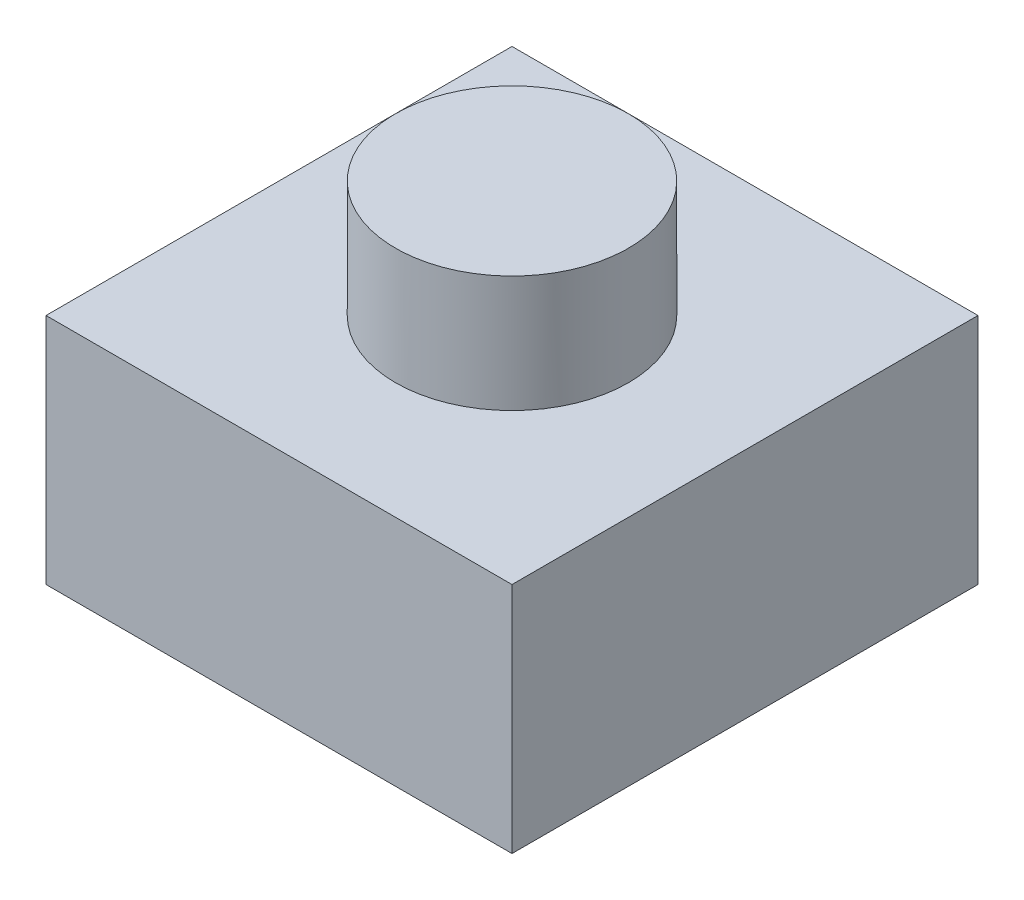
ISO-10303-21;
HEADER;
FILE_DESCRIPTION(('STEP AP214'),'2;1');
FILE_NAME('part.step','',(''),(''),'','','');
FILE_SCHEMA(('AUTOMOTIVE_DESIGN { 1 0 10303 214 1 1 1 1 }'));
ENDSEC;
DATA;
#1=APPLICATION_CONTEXT('core data for automotive mechanical design processes');
#2=APPLICATION_PROTOCOL_DEFINITION('international standard','automotive_design',2000,#1);
#3=PRODUCT_CONTEXT('',#1,'mechanical');
#4=PRODUCT('Part','Part','',(#3));
#5=PRODUCT_RELATED_PRODUCT_CATEGORY('part','',(#4));
#6=PRODUCT_DEFINITION_FORMATION('','',#4);
#7=PRODUCT_DEFINITION_CONTEXT('part definition',#1,'design');
#8=PRODUCT_DEFINITION('design','',#6,#7);
#9=PRODUCT_DEFINITION_SHAPE('','',#8);
#10=(LENGTH_UNIT() NAMED_UNIT(*) SI_UNIT(.MILLI.,.METRE.));
#11=(NAMED_UNIT(*) PLANE_ANGLE_UNIT() SI_UNIT($,.RADIAN.));
#12=(NAMED_UNIT(*) SI_UNIT($,.STERADIAN.) SOLID_ANGLE_UNIT());
#13=UNCERTAINTY_MEASURE_WITH_UNIT(LENGTH_MEASURE(1.E-05),#10,'distance_accuracy_value','');
#14=(GEOMETRIC_REPRESENTATION_CONTEXT(3) GLOBAL_UNCERTAINTY_ASSIGNED_CONTEXT((#13)) GLOBAL_UNIT_ASSIGNED_CONTEXT((#10,
#11,#12)) REPRESENTATION_CONTEXT('',''));
#15=CARTESIAN_POINT('',(0.,0.,0.));
#16=DIRECTION('',(0.,0.,1.));
#17=DIRECTION('',(1.,0.,0.));
#18=AXIS2_PLACEMENT_3D('',#15,#16,#17);
#19=CARTESIAN_POINT('',(0.,40.,0.));
#20=DIRECTION('',(0.,-1.,0.));
#21=DIRECTION('',(0.,0.,-1.));
#22=AXIS2_PLACEMENT_3D('',#19,#20,#21);
#23=PLANE('',#22);
#24=DIRECTION('',(0.,0.,1.));
#25=VECTOR('',#24,1.);
#26=CARTESIAN_POINT('',(0.,40.,0.));
#27=LINE('',#26,#25);
#28=CARTESIAN_POINT('',(0.,40.,-80.));
#29=VERTEX_POINT('',#28);
#30=CARTESIAN_POINT('',(0.,40.,0.));
#31=VERTEX_POINT('',#30);
#32=EDGE_CURVE('E98',#29,#31,#27,.T.);
#33=ORIENTED_EDGE('',*,*,#32,.T.);
#34=DIRECTION('',(1.,0.,0.));
#35=VECTOR('',#34,1.);
#36=CARTESIAN_POINT('',(0.,40.,0.));
#37=LINE('',#36,#35);
#38=CARTESIAN_POINT('',(80.,40.,0.));
#39=VERTEX_POINT('',#38);
#40=EDGE_CURVE('E93',#31,#39,#37,.T.);
#41=ORIENTED_EDGE('',*,*,#40,.T.);
#42=DIRECTION('',(0.,0.,-1.));
#43=VECTOR('',#42,1.);
#44=CARTESIAN_POINT('',(80.,40.,0.));
#45=LINE('',#44,#43);
#46=CARTESIAN_POINT('',(80.,40.,-80.));
#47=VERTEX_POINT('',#46);
#48=EDGE_CURVE('E96',#39,#47,#45,.T.);
#49=ORIENTED_EDGE('',*,*,#48,.T.);
#50=DIRECTION('',(-1.,0.,0.));
#51=VECTOR('',#50,1.);
#52=CARTESIAN_POINT('',(0.,40.,-80.));
#53=LINE('',#52,#51);
#54=EDGE_CURVE('E63',#47,#29,#53,.T.);
#55=ORIENTED_EDGE('',*,*,#54,.T.);
#56=EDGE_LOOP('',(#33,#41,#49,#55));
#57=FACE_BOUND('',#56,.T.);
#58=CARTESIAN_POINT('',(40.,40.,-40.));
#59=DIRECTION('',(0.,1.,0.));
#60=DIRECTION('',(0.,0.,1.));
#61=AXIS2_PLACEMENT_3D('',#58,#59,#60);
#62=CIRCLE('',#61,20.);
#63=CARTESIAN_POINT('',(40.,40.,-20.));
#64=VERTEX_POINT('',#63);
#65=EDGE_CURVE('E118',#64,#64,#62,.T.);
#66=ORIENTED_EDGE('',*,*,#65,.F.);
#67=EDGE_LOOP('',(#66));
#68=FACE_BOUND('',#67,.T.);
#69=ADVANCED_FACE('F45',(#57,#68),#23,.F.);
#70=CARTESIAN_POINT('',(0.,0.,0.));
#71=DIRECTION('',(0.,-1.,0.));
#72=DIRECTION('',(0.,0.,-1.));
#73=AXIS2_PLACEMENT_3D('',#70,#71,#72);
#74=PLANE('',#73);
#75=DIRECTION('',(0.,0.,1.));
#76=VECTOR('',#75,1.);
#77=CARTESIAN_POINT('',(0.,0.,0.));
#78=LINE('',#77,#76);
#79=CARTESIAN_POINT('',(0.,0.,-80.));
#80=VERTEX_POINT('',#79);
#81=CARTESIAN_POINT('',(0.,0.,0.));
#82=VERTEX_POINT('',#81);
#83=EDGE_CURVE('E114',#80,#82,#78,.T.);
#84=ORIENTED_EDGE('',*,*,#83,.F.);
#85=DIRECTION('',(-1.,0.,0.));
#86=VECTOR('',#85,1.);
#87=CARTESIAN_POINT('',(0.,0.,-80.));
#88=LINE('',#87,#86);
#89=CARTESIAN_POINT('',(80.,0.,-80.));
#90=VERTEX_POINT('',#89);
#91=EDGE_CURVE('E86',#90,#80,#88,.T.);
#92=ORIENTED_EDGE('',*,*,#91,.F.);
#93=DIRECTION('',(0.,0.,-1.));
#94=VECTOR('',#93,1.);
#95=CARTESIAN_POINT('',(80.,0.,0.));
#96=LINE('',#95,#94);
#97=CARTESIAN_POINT('',(80.,0.,0.));
#98=VERTEX_POINT('',#97);
#99=EDGE_CURVE('E80',#98,#90,#96,.T.);
#100=ORIENTED_EDGE('',*,*,#99,.F.);
#101=DIRECTION('',(1.,0.,0.));
#102=VECTOR('',#101,1.);
#103=CARTESIAN_POINT('',(0.,0.,0.));
#104=LINE('',#103,#102);
#105=EDGE_CURVE('E103',#82,#98,#104,.T.);
#106=ORIENTED_EDGE('',*,*,#105,.F.);
#107=EDGE_LOOP('',(#84,#92,#100,#106));
#108=FACE_BOUND('',#107,.T.);
#109=ADVANCED_FACE('F131',(#108),#74,.T.);
#110=CARTESIAN_POINT('',(0.,40.,0.));
#111=DIRECTION('',(1.,0.,0.));
#112=DIRECTION('',(0.,0.,-1.));
#113=AXIS2_PLACEMENT_3D('',#110,#111,#112);
#114=PLANE('',#113);
#115=ORIENTED_EDGE('',*,*,#83,.T.);
#116=DIRECTION('',(0.,-1.,0.));
#117=VECTOR('',#116,1.);
#118=CARTESIAN_POINT('',(0.,40.,0.));
#119=LINE('',#118,#117);
#120=EDGE_CURVE('E12',#31,#82,#119,.T.);
#121=ORIENTED_EDGE('',*,*,#120,.F.);
#122=ORIENTED_EDGE('',*,*,#32,.F.);
#123=DIRECTION('',(0.,-1.,0.));
#124=VECTOR('',#123,1.);
#125=CARTESIAN_POINT('',(0.,40.,-80.));
#126=LINE('',#125,#124);
#127=EDGE_CURVE('E110',#29,#80,#126,.T.);
#128=ORIENTED_EDGE('',*,*,#127,.T.);
#129=EDGE_LOOP('',(#115,#121,#122,#128));
#130=FACE_BOUND('',#129,.T.);
#131=ADVANCED_FACE('F47',(#130),#114,.F.);
#132=CARTESIAN_POINT('',(0.,40.,0.));
#133=DIRECTION('',(0.,0.,-1.));
#134=DIRECTION('',(-1.,0.,0.));
#135=AXIS2_PLACEMENT_3D('',#132,#133,#134);
#136=PLANE('',#135);
#137=ORIENTED_EDGE('',*,*,#105,.T.);
#138=DIRECTION('',(0.,-1.,0.));
#139=VECTOR('',#138,1.);
#140=CARTESIAN_POINT('',(80.,40.,0.));
#141=LINE('',#140,#139);
#142=EDGE_CURVE('E55',#39,#98,#141,.T.);
#143=ORIENTED_EDGE('',*,*,#142,.F.);
#144=ORIENTED_EDGE('',*,*,#40,.F.);
#145=ORIENTED_EDGE('',*,*,#120,.T.);
#146=EDGE_LOOP('',(#137,#143,#144,#145));
#147=FACE_BOUND('',#146,.T.);
#148=ADVANCED_FACE('F102',(#147),#136,.F.);
#149=CARTESIAN_POINT('',(80.,40.,0.));
#150=DIRECTION('',(-1.,0.,0.));
#151=DIRECTION('',(0.,0.,1.));
#152=AXIS2_PLACEMENT_3D('',#149,#150,#151);
#153=PLANE('',#152);
#154=ORIENTED_EDGE('',*,*,#99,.T.);
#155=DIRECTION('',(0.,-1.,0.));
#156=VECTOR('',#155,1.);
#157=CARTESIAN_POINT('',(80.,40.,-80.));
#158=LINE('',#157,#156);
#159=EDGE_CURVE('E105',#47,#90,#158,.T.);
#160=ORIENTED_EDGE('',*,*,#159,.F.);
#161=ORIENTED_EDGE('',*,*,#48,.F.);
#162=ORIENTED_EDGE('',*,*,#142,.T.);
#163=EDGE_LOOP('',(#154,#160,#161,#162));
#164=FACE_BOUND('',#163,.T.);
#165=ADVANCED_FACE('F106',(#164),#153,.F.);
#166=CARTESIAN_POINT('',(0.,40.,-80.));
#167=DIRECTION('',(0.,0.,1.));
#168=DIRECTION('',(1.,0.,0.));
#169=AXIS2_PLACEMENT_3D('',#166,#167,#168);
#170=PLANE('',#169);
#171=ORIENTED_EDGE('',*,*,#91,.T.);
#172=ORIENTED_EDGE('',*,*,#127,.F.);
#173=ORIENTED_EDGE('',*,*,#54,.F.);
#174=ORIENTED_EDGE('',*,*,#159,.T.);
#175=EDGE_LOOP('',(#171,#172,#173,#174));
#176=FACE_BOUND('',#175,.T.);
#177=ADVANCED_FACE('F128',(#176),#170,.F.);
#178=CARTESIAN_POINT('',(40.,136.568542494924,-40.));
#179=DIRECTION('',(0.,-1.,0.));
#180=DIRECTION('',(0.,0.,-1.));
#181=AXIS2_PLACEMENT_3D('',#178,#179,#180);
#182=CYLINDRICAL_SURFACE('',#181,20.);
#183=CARTESIAN_POINT('',(40.,60.,-40.));
#184=DIRECTION('',(0.,-1.,0.));
#185=DIRECTION('',(0.,0.,-1.));
#186=AXIS2_PLACEMENT_3D('',#183,#184,#185);
#187=CIRCLE('',#186,20.);
#188=CARTESIAN_POINT('',(40.,60.,-60.));
#189=VERTEX_POINT('',#188);
#190=EDGE_CURVE('E138',#189,#189,#187,.T.);
#191=ORIENTED_EDGE('',*,*,#190,.T.);
#192=EDGE_LOOP('',(#191));
#193=FACE_BOUND('',#192,.T.);
#194=ORIENTED_EDGE('',*,*,#65,.T.);
#195=EDGE_LOOP('',(#194));
#196=FACE_BOUND('',#195,.T.);
#197=ADVANCED_FACE('F143',(#193,#196),#182,.T.);
#198=CARTESIAN_POINT('',(0.,60.,0.));
#199=DIRECTION('',(0.,-1.,0.));
#200=DIRECTION('',(0.,0.,-1.));
#201=AXIS2_PLACEMENT_3D('',#198,#199,#200);
#202=PLANE('',#201);
#203=ORIENTED_EDGE('',*,*,#190,.F.);
#204=EDGE_LOOP('',(#203));
#205=FACE_BOUND('',#204,.T.);
#206=ADVANCED_FACE('F146',(#205),#202,.F.);
#207=CLOSED_SHELL('',(#69,#109,#131,#148,#165,#177,#197,#206));
#208=MANIFOLD_SOLID_BREP('B2',#207);
#209=ADVANCED_BREP_SHAPE_REPRESENTATION('',(#18,#208),#14);
#210=SHAPE_DEFINITION_REPRESENTATION(#9,#209);
ENDSEC;
END-ISO-10303-21;
